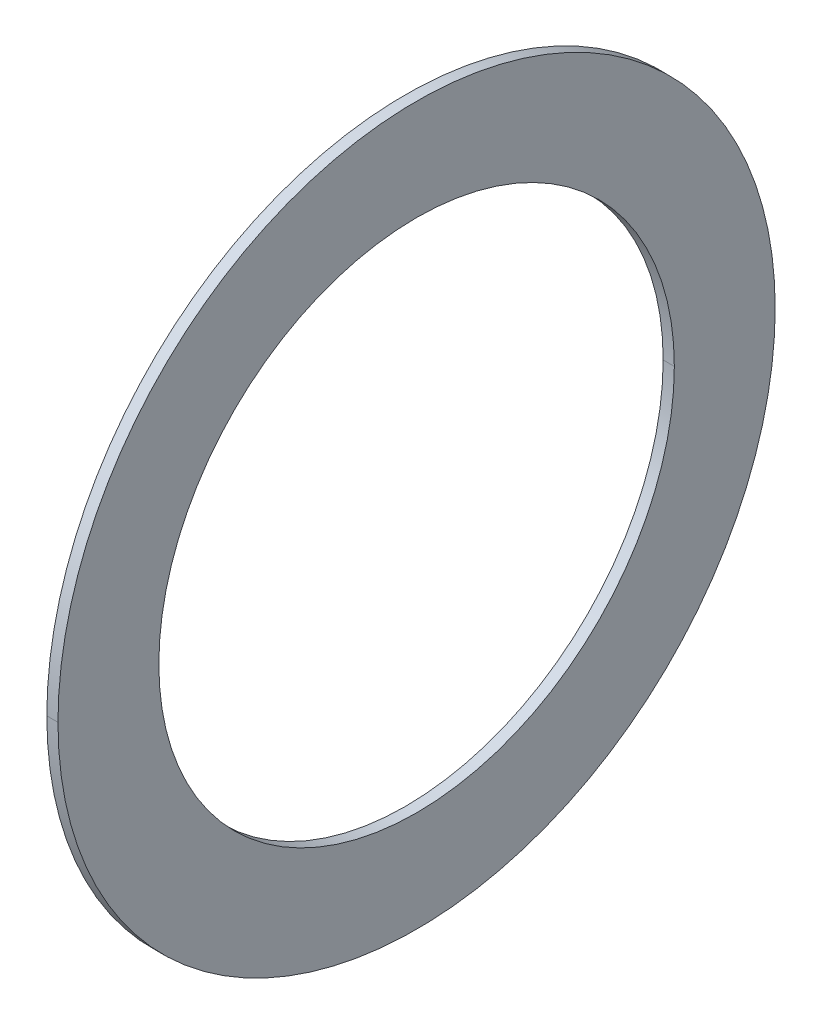
ISO-10303-21;
HEADER;
FILE_DESCRIPTION(('STEP AP214'),'2;1');
FILE_NAME('part.step','',(''),(''),'','','');
FILE_SCHEMA(('AUTOMOTIVE_DESIGN { 1 0 10303 214 1 1 1 1 }'));
ENDSEC;
DATA;
#1=APPLICATION_CONTEXT('core data for automotive mechanical design processes');
#2=APPLICATION_PROTOCOL_DEFINITION('international standard','automotive_design',2000,#1);
#3=PRODUCT_CONTEXT('',#1,'mechanical');
#4=PRODUCT('Part','Part','',(#3));
#5=PRODUCT_RELATED_PRODUCT_CATEGORY('part','',(#4));
#6=PRODUCT_DEFINITION_FORMATION('','',#4);
#7=PRODUCT_DEFINITION_CONTEXT('part definition',#1,'design');
#8=PRODUCT_DEFINITION('design','',#6,#7);
#9=PRODUCT_DEFINITION_SHAPE('','',#8);
#10=(LENGTH_UNIT() NAMED_UNIT(*) SI_UNIT(.MILLI.,.METRE.));
#11=(NAMED_UNIT(*) PLANE_ANGLE_UNIT() SI_UNIT($,.RADIAN.));
#12=(NAMED_UNIT(*) SI_UNIT($,.STERADIAN.) SOLID_ANGLE_UNIT());
#13=UNCERTAINTY_MEASURE_WITH_UNIT(LENGTH_MEASURE(1.E-05),#10,'distance_accuracy_value','');
#14=(GEOMETRIC_REPRESENTATION_CONTEXT(3) GLOBAL_UNCERTAINTY_ASSIGNED_CONTEXT((#13)) GLOBAL_UNIT_ASSIGNED_CONTEXT((#10,
#11,#12)) REPRESENTATION_CONTEXT('',''));
#15=CARTESIAN_POINT('',(0.,0.,0.));
#16=DIRECTION('',(0.,0.,1.));
#17=DIRECTION('',(1.,0.,0.));
#18=AXIS2_PLACEMENT_3D('',#15,#16,#17);
#19=CARTESIAN_POINT('',(0.2656,6.4,0.));
#20=DIRECTION('',(-1.,0.,0.));
#21=DIRECTION('',(0.,0.,1.));
#22=AXIS2_PLACEMENT_3D('',#19,#20,#21);
#23=PLANE('',#22);
#24=CARTESIAN_POINT('',(0.2656,0.,0.));
#25=DIRECTION('',(1.,0.,0.));
#26=DIRECTION('',(0.,0.,-1.));
#27=AXIS2_PLACEMENT_3D('',#24,#25,#26);
#28=CIRCLE('',#27,4.6);
#29=CARTESIAN_POINT('',(0.2656,0.,-4.6));
#30=VERTEX_POINT('',#29);
#31=CARTESIAN_POINT('',(0.2656,0.,4.6));
#32=VERTEX_POINT('',#31);
#33=EDGE_CURVE('E90',#30,#32,#28,.T.);
#34=ORIENTED_EDGE('',*,*,#33,.T.);
#35=CARTESIAN_POINT('',(0.2656,0.,0.));
#36=DIRECTION('',(1.,0.,0.));
#37=DIRECTION('',(0.,0.,-1.));
#38=AXIS2_PLACEMENT_3D('',#35,#36,#37);
#39=CIRCLE('',#38,4.6);
#40=EDGE_CURVE('E11',#32,#30,#39,.T.);
#41=ORIENTED_EDGE('',*,*,#40,.T.);
#42=EDGE_LOOP('',(#34,#41));
#43=FACE_BOUND('',#42,.T.);
#44=CARTESIAN_POINT('',(0.2656,0.,0.));
#45=DIRECTION('',(1.,0.,0.));
#46=DIRECTION('',(0.,0.,-1.));
#47=AXIS2_PLACEMENT_3D('',#44,#45,#46);
#48=CIRCLE('',#47,6.4);
#49=CARTESIAN_POINT('',(0.2656,0.,-6.4));
#50=VERTEX_POINT('',#49);
#51=CARTESIAN_POINT('',(0.2656,0.,6.4));
#52=VERTEX_POINT('',#51);
#53=EDGE_CURVE('E21',#50,#52,#48,.T.);
#54=ORIENTED_EDGE('',*,*,#53,.F.);
#55=CARTESIAN_POINT('',(0.2656,0.,0.));
#56=DIRECTION('',(1.,0.,0.));
#57=DIRECTION('',(0.,0.,-1.));
#58=AXIS2_PLACEMENT_3D('',#55,#56,#57);
#59=CIRCLE('',#58,6.4);
#60=EDGE_CURVE('E79',#52,#50,#59,.T.);
#61=ORIENTED_EDGE('',*,*,#60,.F.);
#62=EDGE_LOOP('',(#54,#61));
#63=FACE_BOUND('',#62,.T.);
#64=ADVANCED_FACE('F17',(#43,#63),#23,.T.);
#65=CARTESIAN_POINT('',(0.4648,0.,0.));
#66=DIRECTION('',(-1.,0.,0.));
#67=DIRECTION('',(0.,0.,-1.));
#68=AXIS2_PLACEMENT_3D('',#65,#66,#67);
#69=CYLINDRICAL_SURFACE('',#68,4.6);
#70=DIRECTION('',(-1.,0.,0.));
#71=VECTOR('',#70,1.);
#72=CARTESIAN_POINT('',(0.4648,0.,4.6));
#73=LINE('',#72,#71);
#74=CARTESIAN_POINT('',(0.4648,0.,4.6));
#75=VERTEX_POINT('',#74);
#76=EDGE_CURVE('E97',#75,#32,#73,.T.);
#77=ORIENTED_EDGE('',*,*,#76,.F.);
#78=CARTESIAN_POINT('',(0.4648,0.,0.));
#79=DIRECTION('',(1.,0.,0.));
#80=DIRECTION('',(0.,0.,-1.));
#81=AXIS2_PLACEMENT_3D('',#78,#79,#80);
#82=CIRCLE('',#81,4.6);
#83=CARTESIAN_POINT('',(0.4648,0.,-4.6));
#84=VERTEX_POINT('',#83);
#85=EDGE_CURVE('E28',#75,#84,#82,.T.);
#86=ORIENTED_EDGE('',*,*,#85,.T.);
#87=DIRECTION('',(-1.,0.,0.));
#88=VECTOR('',#87,1.);
#89=CARTESIAN_POINT('',(0.4648,0.,-4.6));
#90=LINE('',#89,#88);
#91=EDGE_CURVE('E83',#84,#30,#90,.T.);
#92=ORIENTED_EDGE('',*,*,#91,.T.);
#93=ORIENTED_EDGE('',*,*,#40,.F.);
#94=EDGE_LOOP('',(#77,#86,#92,#93));
#95=FACE_BOUND('',#94,.T.);
#96=ADVANCED_FACE('F125',(#95),#69,.F.);
#97=CARTESIAN_POINT('',(0.4648,4.6,0.));
#98=DIRECTION('',(1.,0.,0.));
#99=DIRECTION('',(0.,1.,0.));
#100=AXIS2_PLACEMENT_3D('',#97,#98,#99);
#101=PLANE('',#100);
#102=CARTESIAN_POINT('',(0.4648,0.,0.));
#103=DIRECTION('',(1.,0.,0.));
#104=DIRECTION('',(0.,0.,-1.));
#105=AXIS2_PLACEMENT_3D('',#102,#103,#104);
#106=CIRCLE('',#105,4.6);
#107=EDGE_CURVE('E94',#84,#75,#106,.T.);
#108=ORIENTED_EDGE('',*,*,#107,.F.);
#109=ORIENTED_EDGE('',*,*,#85,.F.);
#110=EDGE_LOOP('',(#108,#109));
#111=FACE_BOUND('',#110,.T.);
#112=CARTESIAN_POINT('',(0.4648,0.,0.));
#113=DIRECTION('',(1.,0.,0.));
#114=DIRECTION('',(0.,0.,-1.));
#115=AXIS2_PLACEMENT_3D('',#112,#113,#114);
#116=CIRCLE('',#115,6.4);
#117=CARTESIAN_POINT('',(0.4648,0.,-6.4));
#118=VERTEX_POINT('',#117);
#119=CARTESIAN_POINT('',(0.4648,0.,6.4));
#120=VERTEX_POINT('',#119);
#121=EDGE_CURVE('E62',#118,#120,#116,.T.);
#122=ORIENTED_EDGE('',*,*,#121,.T.);
#123=CARTESIAN_POINT('',(0.4648,0.,0.));
#124=DIRECTION('',(1.,0.,0.));
#125=DIRECTION('',(0.,0.,-1.));
#126=AXIS2_PLACEMENT_3D('',#123,#124,#125);
#127=CIRCLE('',#126,6.4);
#128=EDGE_CURVE('E71',#120,#118,#127,.T.);
#129=ORIENTED_EDGE('',*,*,#128,.T.);
#130=EDGE_LOOP('',(#122,#129));
#131=FACE_BOUND('',#130,.T.);
#132=ADVANCED_FACE('F69',(#111,#131),#101,.T.);
#133=CARTESIAN_POINT('',(0.4648,0.,0.));
#134=DIRECTION('',(-1.,0.,0.));
#135=DIRECTION('',(0.,0.,-1.));
#136=AXIS2_PLACEMENT_3D('',#133,#134,#135);
#137=CYLINDRICAL_SURFACE('',#136,6.4);
#138=DIRECTION('',(-1.,0.,0.));
#139=VECTOR('',#138,1.);
#140=CARTESIAN_POINT('',(0.4648,0.,6.4));
#141=LINE('',#140,#139);
#142=EDGE_CURVE('E75',#120,#52,#141,.T.);
#143=ORIENTED_EDGE('',*,*,#142,.F.);
#144=ORIENTED_EDGE('',*,*,#121,.F.);
#145=DIRECTION('',(-1.,0.,0.));
#146=VECTOR('',#145,1.);
#147=CARTESIAN_POINT('',(0.4648,0.,-6.4));
#148=LINE('',#147,#146);
#149=EDGE_CURVE('E73',#118,#50,#148,.T.);
#150=ORIENTED_EDGE('',*,*,#149,.T.);
#151=ORIENTED_EDGE('',*,*,#53,.T.);
#152=EDGE_LOOP('',(#143,#144,#150,#151));
#153=FACE_BOUND('',#152,.T.);
#154=ADVANCED_FACE('F19',(#153),#137,.T.);
#155=CARTESIAN_POINT('',(0.4648,0.,0.));
#156=DIRECTION('',(-1.,0.,0.));
#157=DIRECTION('',(0.,0.,-1.));
#158=AXIS2_PLACEMENT_3D('',#155,#156,#157);
#159=CYLINDRICAL_SURFACE('',#158,6.4);
#160=ORIENTED_EDGE('',*,*,#128,.F.);
#161=ORIENTED_EDGE('',*,*,#142,.T.);
#162=ORIENTED_EDGE('',*,*,#60,.T.);
#163=ORIENTED_EDGE('',*,*,#149,.F.);
#164=EDGE_LOOP('',(#160,#161,#162,#163));
#165=FACE_BOUND('',#164,.T.);
#166=ADVANCED_FACE('F81',(#165),#159,.T.);
#167=CARTESIAN_POINT('',(0.4648,0.,0.));
#168=DIRECTION('',(-1.,0.,0.));
#169=DIRECTION('',(0.,0.,-1.));
#170=AXIS2_PLACEMENT_3D('',#167,#168,#169);
#171=CYLINDRICAL_SURFACE('',#170,4.6);
#172=ORIENTED_EDGE('',*,*,#107,.T.);
#173=ORIENTED_EDGE('',*,*,#76,.T.);
#174=ORIENTED_EDGE('',*,*,#33,.F.);
#175=ORIENTED_EDGE('',*,*,#91,.F.);
#176=EDGE_LOOP('',(#172,#173,#174,#175));
#177=FACE_BOUND('',#176,.T.);
#178=ADVANCED_FACE('F118',(#177),#171,.F.);
#179=CLOSED_SHELL('',(#64,#96,#132,#154,#166,#178));
#180=MANIFOLD_SOLID_BREP('B1',#179);
#181=ADVANCED_BREP_SHAPE_REPRESENTATION('',(#18,#180),#14);
#182=SHAPE_DEFINITION_REPRESENTATION(#9,#181);
ENDSEC;
END-ISO-10303-21;
